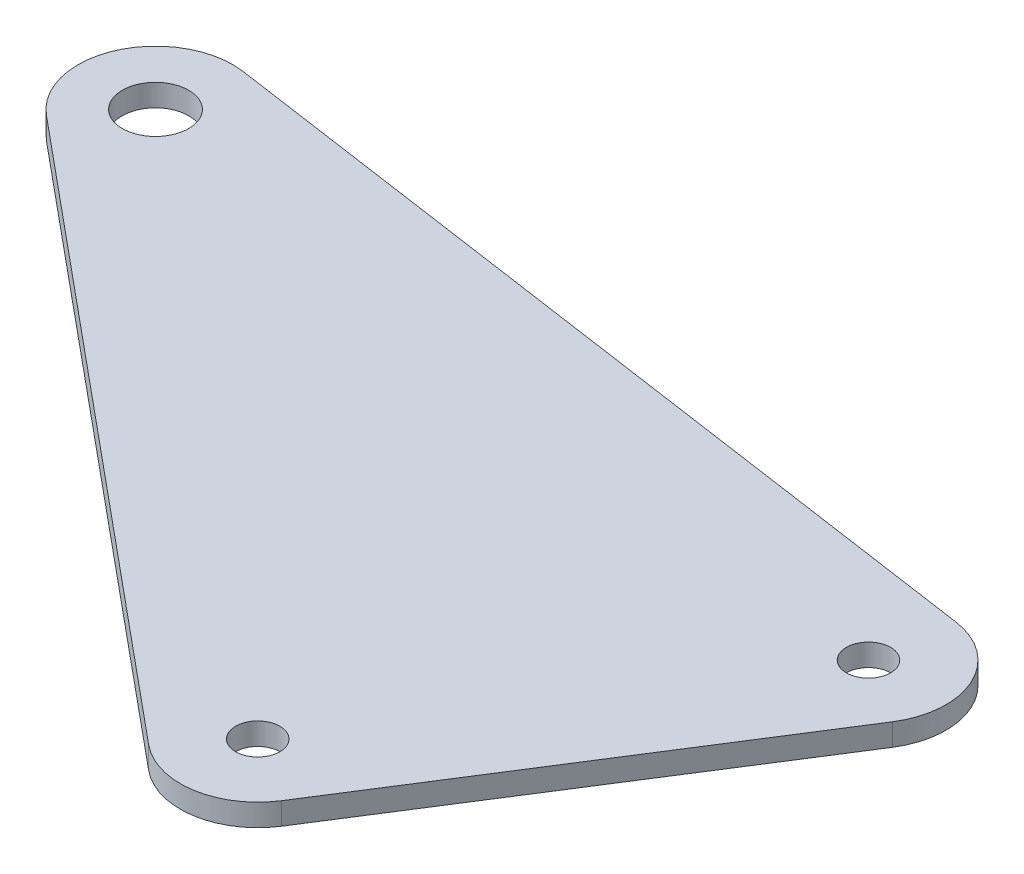
ISO-10303-21;
HEADER;
FILE_DESCRIPTION(('STEP AP214'),'2;1');
FILE_NAME('part.step','',(''),(''),'','','');
FILE_SCHEMA(('AUTOMOTIVE_DESIGN { 1 0 10303 214 1 1 1 1 }'));
ENDSEC;
DATA;
#1=APPLICATION_CONTEXT('core data for automotive mechanical design processes');
#2=APPLICATION_PROTOCOL_DEFINITION('international standard','automotive_design',2000,#1);
#3=PRODUCT_CONTEXT('',#1,'mechanical');
#4=PRODUCT('Part','Part','',(#3));
#5=PRODUCT_RELATED_PRODUCT_CATEGORY('part','',(#4));
#6=PRODUCT_DEFINITION_FORMATION('','',#4);
#7=PRODUCT_DEFINITION_CONTEXT('part definition',#1,'design');
#8=PRODUCT_DEFINITION('design','',#6,#7);
#9=PRODUCT_DEFINITION_SHAPE('','',#8);
#10=(LENGTH_UNIT() NAMED_UNIT(*) SI_UNIT(.MILLI.,.METRE.));
#11=(NAMED_UNIT(*) PLANE_ANGLE_UNIT() SI_UNIT($,.RADIAN.));
#12=(NAMED_UNIT(*) SI_UNIT($,.STERADIAN.) SOLID_ANGLE_UNIT());
#13=UNCERTAINTY_MEASURE_WITH_UNIT(LENGTH_MEASURE(1.E-05),#10,'distance_accuracy_value','');
#14=(GEOMETRIC_REPRESENTATION_CONTEXT(3) GLOBAL_UNCERTAINTY_ASSIGNED_CONTEXT((#13)) GLOBAL_UNIT_ASSIGNED_CONTEXT((#10,
#11,#12)) REPRESENTATION_CONTEXT('',''));
#15=CARTESIAN_POINT('',(0.,0.,0.));
#16=DIRECTION('',(0.,0.,1.));
#17=DIRECTION('',(1.,0.,0.));
#18=AXIS2_PLACEMENT_3D('',#15,#16,#17);
#19=CARTESIAN_POINT('',(1879.07689268095,2.,-1032.16454737156));
#20=DIRECTION('',(0.,1.,0.));
#21=DIRECTION('',(0.,0.,-1.));
#22=AXIS2_PLACEMENT_3D('',#19,#20,#21);
#23=PLANE('',#22);
#24=CARTESIAN_POINT('',(1857.64903987547,2.,-998.388118842978));
#25=DIRECTION('',(0.,-1.,0.));
#26=DIRECTION('',(0.,0.,-1.));
#27=AXIS2_PLACEMENT_3D('',#24,#25,#26);
#28=CIRCLE('',#27,2.0000000000001);
#29=CARTESIAN_POINT('',(1857.64903987547,2.,-1000.38811884298));
#30=VERTEX_POINT('',#29);
#31=EDGE_CURVE('E154',#30,#30,#28,.T.);
#32=ORIENTED_EDGE('',*,*,#31,.T.);
#33=EDGE_LOOP('',(#32));
#34=FACE_BOUND('',#33,.T.);
#35=CARTESIAN_POINT('',(1879.07689268095,2.,-1032.16454737156));
#36=DIRECTION('',(0.,-1.,0.));
#37=DIRECTION('',(0.,0.,-1.));
#38=AXIS2_PLACEMENT_3D('',#35,#36,#37);
#39=CIRCLE('',#38,7.00000000000004);
#40=CARTESIAN_POINT('',(1880.077927524,2.,-1039.09260115621));
#41=VERTEX_POINT('',#40);
#42=CARTESIAN_POINT('',(1884.98776767346,2.,-1028.4146731306));
#43=VERTEX_POINT('',#42);
#44=EDGE_CURVE('E137',#41,#43,#39,.T.);
#45=ORIENTED_EDGE('',*,*,#44,.F.);
#46=DIRECTION('',(0.989721969235761,0.,0.143004977578013));
#47=VECTOR('',#46,1.);
#48=CARTESIAN_POINT('',(1880.077927524,2.,-1039.09260115621));
#49=LINE('',#48,#47);
#50=CARTESIAN_POINT('',(1804.74821126252,2.,-1049.97699568294));
#51=VERTEX_POINT('',#50);
#52=EDGE_CURVE('E117',#51,#41,#49,.T.);
#53=ORIENTED_EDGE('',*,*,#52,.F.);
#54=CARTESIAN_POINT('',(1803.74717641947,2.,-1043.04894189829));
#55=DIRECTION('',(0.,-1.,0.));
#56=DIRECTION('',(0.,0.,-1.));
#57=AXIS2_PLACEMENT_3D('',#54,#55,#56);
#58=CIRCLE('',#57,6.99999999999989);
#59=CARTESIAN_POINT('',(1799.28109411394,2.,-1037.6587555527));
#60=VERTEX_POINT('',#59);
#61=EDGE_CURVE('E98',#60,#51,#58,.T.);
#62=ORIENTED_EDGE('',*,*,#61,.F.);
#63=DIRECTION('',(-0.770026620799455,0.,-0.638011757932542));
#64=VECTOR('',#63,1.);
#65=CARTESIAN_POINT('',(1799.28109411394,2.,-1037.6587555527));
#66=LINE('',#65,#64);
#67=CARTESIAN_POINT('',(1853.18295756995,2.,-992.997932497383));
#68=VERTEX_POINT('',#67);
#69=EDGE_CURVE('E108',#68,#60,#66,.T.);
#70=ORIENTED_EDGE('',*,*,#69,.F.);
#71=CARTESIAN_POINT('',(1857.64903987547,2.,-998.388118842978));
#72=DIRECTION('',(0.,-1.,0.));
#73=DIRECTION('',(0.,0.,-1.));
#74=AXIS2_PLACEMENT_3D('',#71,#72,#73);
#75=CIRCLE('',#74,6.99999999999981);
#76=CARTESIAN_POINT('',(1863.55991486798,2.,-994.638244602019));
#77=VERTEX_POINT('',#76);
#78=EDGE_CURVE('E113',#77,#68,#75,.T.);
#79=ORIENTED_EDGE('',*,*,#78,.F.);
#80=DIRECTION('',(-0.535696320137016,0.,0.844410713214642));
#81=VECTOR('',#80,1.);
#82=CARTESIAN_POINT('',(1884.98776767346,2.,-1028.4146731306));
#83=LINE('',#82,#81);
#84=EDGE_CURVE('E142',#43,#77,#83,.T.);
#85=ORIENTED_EDGE('',*,*,#84,.F.);
#86=EDGE_LOOP('',(#45,#53,#62,#70,#79,#85));
#87=FACE_BOUND('',#86,.T.);
#88=CARTESIAN_POINT('',(1803.74717641947,2.,-1043.04894189829));
#89=DIRECTION('',(0.,-1.,0.));
#90=DIRECTION('',(0.,0.,-1.));
#91=AXIS2_PLACEMENT_3D('',#88,#89,#90);
#92=CIRCLE('',#91,2.99999999999994);
#93=CARTESIAN_POINT('',(1803.74717641947,2.,-1046.04894189829));
#94=VERTEX_POINT('',#93);
#95=EDGE_CURVE('E126',#94,#94,#92,.T.);
#96=ORIENTED_EDGE('',*,*,#95,.T.);
#97=EDGE_LOOP('',(#96));
#98=FACE_BOUND('',#97,.T.);
#99=CARTESIAN_POINT('',(1879.07689268095,2.,-1032.16454737156));
#100=DIRECTION('',(0.,-1.,0.));
#101=DIRECTION('',(0.,0.,-1.));
#102=AXIS2_PLACEMENT_3D('',#99,#100,#101);
#103=CIRCLE('',#102,2.0000000000001);
#104=CARTESIAN_POINT('',(1879.07689268095,2.,-1034.16454737156));
#105=VERTEX_POINT('',#104);
#106=EDGE_CURVE('E160',#105,#105,#103,.T.);
#107=ORIENTED_EDGE('',*,*,#106,.T.);
#108=EDGE_LOOP('',(#107));
#109=FACE_BOUND('',#108,.T.);
#110=ADVANCED_FACE('F37',(#34,#87,#98,#109),#23,.T.);
#111=CARTESIAN_POINT('',(1879.07689268095,0.,-1032.16454737156));
#112=DIRECTION('',(0.,1.,0.));
#113=DIRECTION('',(0.,0.,-1.));
#114=AXIS2_PLACEMENT_3D('',#111,#112,#113);
#115=PLANE('',#114);
#116=CARTESIAN_POINT('',(1879.07689268095,0.,-1032.16454737156));
#117=DIRECTION('',(0.,-1.,0.));
#118=DIRECTION('',(0.,0.,-1.));
#119=AXIS2_PLACEMENT_3D('',#116,#117,#118);
#120=CIRCLE('',#119,7.00000000000004);
#121=CARTESIAN_POINT('',(1880.077927524,0.,-1039.09260115621));
#122=VERTEX_POINT('',#121);
#123=CARTESIAN_POINT('',(1884.98776767346,0.,-1028.4146731306));
#124=VERTEX_POINT('',#123);
#125=EDGE_CURVE('E122',#122,#124,#120,.T.);
#126=ORIENTED_EDGE('',*,*,#125,.T.);
#127=DIRECTION('',(-0.535696320137016,0.,0.844410713214642));
#128=VECTOR('',#127,1.);
#129=CARTESIAN_POINT('',(1884.98776767346,0.,-1028.4146731306));
#130=LINE('',#129,#128);
#131=CARTESIAN_POINT('',(1863.55991486798,0.,-994.638244602019));
#132=VERTEX_POINT('',#131);
#133=EDGE_CURVE('E125',#124,#132,#130,.T.);
#134=ORIENTED_EDGE('',*,*,#133,.T.);
#135=CARTESIAN_POINT('',(1857.64903987547,0.,-998.388118842978));
#136=DIRECTION('',(0.,-1.,0.));
#137=DIRECTION('',(0.,0.,-1.));
#138=AXIS2_PLACEMENT_3D('',#135,#136,#137);
#139=CIRCLE('',#138,6.99999999999981);
#140=CARTESIAN_POINT('',(1853.18295756995,0.,-992.997932497383));
#141=VERTEX_POINT('',#140);
#142=EDGE_CURVE('E129',#132,#141,#139,.T.);
#143=ORIENTED_EDGE('',*,*,#142,.T.);
#144=DIRECTION('',(-0.770026620799455,0.,-0.638011757932542));
#145=VECTOR('',#144,1.);
#146=CARTESIAN_POINT('',(1799.28109411394,0.,-1037.6587555527));
#147=LINE('',#146,#145);
#148=CARTESIAN_POINT('',(1799.28109411394,0.,-1037.6587555527));
#149=VERTEX_POINT('',#148);
#150=EDGE_CURVE('E132',#141,#149,#147,.T.);
#151=ORIENTED_EDGE('',*,*,#150,.T.);
#152=CARTESIAN_POINT('',(1803.74717641947,0.,-1043.04894189829));
#153=DIRECTION('',(0.,-1.,0.));
#154=DIRECTION('',(0.,0.,-1.));
#155=AXIS2_PLACEMENT_3D('',#152,#153,#154);
#156=CIRCLE('',#155,6.99999999999989);
#157=CARTESIAN_POINT('',(1804.74821126252,0.,-1049.97699568294));
#158=VERTEX_POINT('',#157);
#159=EDGE_CURVE('E101',#149,#158,#156,.T.);
#160=ORIENTED_EDGE('',*,*,#159,.T.);
#161=DIRECTION('',(0.989721969235761,0.,0.143004977578013));
#162=VECTOR('',#161,1.);
#163=CARTESIAN_POINT('',(1880.077927524,0.,-1039.09260115621));
#164=LINE('',#163,#162);
#165=EDGE_CURVE('E135',#158,#122,#164,.T.);
#166=ORIENTED_EDGE('',*,*,#165,.T.);
#167=EDGE_LOOP('',(#126,#134,#143,#151,#160,#166));
#168=FACE_BOUND('',#167,.T.);
#169=CARTESIAN_POINT('',(1803.74717641947,0.,-1043.04894189829));
#170=DIRECTION('',(0.,-1.,0.));
#171=DIRECTION('',(0.,0.,-1.));
#172=AXIS2_PLACEMENT_3D('',#169,#170,#171);
#173=CIRCLE('',#172,2.99999999999994);
#174=CARTESIAN_POINT('',(1803.74717641947,0.,-1046.04894189829));
#175=VERTEX_POINT('',#174);
#176=EDGE_CURVE('E151',#175,#175,#173,.T.);
#177=ORIENTED_EDGE('',*,*,#176,.F.);
#178=EDGE_LOOP('',(#177));
#179=FACE_BOUND('',#178,.T.);
#180=CARTESIAN_POINT('',(1857.64903987547,0.,-998.388118842978));
#181=DIRECTION('',(0.,-1.,0.));
#182=DIRECTION('',(0.,0.,-1.));
#183=AXIS2_PLACEMENT_3D('',#180,#181,#182);
#184=CIRCLE('',#183,2.0000000000001);
#185=CARTESIAN_POINT('',(1857.64903987547,0.,-1000.38811884298));
#186=VERTEX_POINT('',#185);
#187=EDGE_CURVE('E157',#186,#186,#184,.T.);
#188=ORIENTED_EDGE('',*,*,#187,.F.);
#189=EDGE_LOOP('',(#188));
#190=FACE_BOUND('',#189,.T.);
#191=CARTESIAN_POINT('',(1879.07689268095,0.,-1032.16454737156));
#192=DIRECTION('',(0.,-1.,0.));
#193=DIRECTION('',(0.,0.,-1.));
#194=AXIS2_PLACEMENT_3D('',#191,#192,#193);
#195=CIRCLE('',#194,2.0000000000001);
#196=CARTESIAN_POINT('',(1879.07689268095,0.,-1034.16454737156));
#197=VERTEX_POINT('',#196);
#198=EDGE_CURVE('E163',#197,#197,#195,.T.);
#199=ORIENTED_EDGE('',*,*,#198,.F.);
#200=EDGE_LOOP('',(#199));
#201=FACE_BOUND('',#200,.T.);
#202=ADVANCED_FACE('F146',(#168,#179,#190,#201),#115,.F.);
#203=CARTESIAN_POINT('',(1879.07689268095,2.,-1032.16454737156));
#204=DIRECTION('',(0.,-1.,0.));
#205=DIRECTION('',(0.,0.,1.));
#206=AXIS2_PLACEMENT_3D('',#203,#204,#205);
#207=CYLINDRICAL_SURFACE('',#206,7.00000000000004);
#208=ORIENTED_EDGE('',*,*,#125,.F.);
#209=DIRECTION('',(0.,-1.,0.));
#210=VECTOR('',#209,1.);
#211=CARTESIAN_POINT('',(1880.077927524,2.,-1039.09260115621));
#212=LINE('',#211,#210);
#213=EDGE_CURVE('E54',#41,#122,#212,.T.);
#214=ORIENTED_EDGE('',*,*,#213,.F.);
#215=ORIENTED_EDGE('',*,*,#44,.T.);
#216=DIRECTION('',(0.,-1.,0.));
#217=VECTOR('',#216,1.);
#218=CARTESIAN_POINT('',(1884.98776767346,2.,-1028.4146731306));
#219=LINE('',#218,#217);
#220=EDGE_CURVE('E11',#43,#124,#219,.T.);
#221=ORIENTED_EDGE('',*,*,#220,.T.);
#222=EDGE_LOOP('',(#208,#214,#215,#221));
#223=FACE_BOUND('',#222,.T.);
#224=ADVANCED_FACE('F39',(#223),#207,.T.);
#225=CARTESIAN_POINT('',(1884.98776767346,2.,-1028.4146731306));
#226=DIRECTION('',(-0.844410713214642,0.,-0.535696320137016));
#227=DIRECTION('',(0.535696320137016,0.,-0.844410713214642));
#228=AXIS2_PLACEMENT_3D('',#225,#226,#227);
#229=PLANE('',#228);
#230=ORIENTED_EDGE('',*,*,#133,.F.);
#231=ORIENTED_EDGE('',*,*,#220,.F.);
#232=ORIENTED_EDGE('',*,*,#84,.T.);
#233=DIRECTION('',(0.,-1.,0.));
#234=VECTOR('',#233,1.);
#235=CARTESIAN_POINT('',(1863.55991486798,2.,-994.638244602019));
#236=LINE('',#235,#234);
#237=EDGE_CURVE('E46',#77,#132,#236,.T.);
#238=ORIENTED_EDGE('',*,*,#237,.T.);
#239=EDGE_LOOP('',(#230,#231,#232,#238));
#240=FACE_BOUND('',#239,.T.);
#241=ADVANCED_FACE('F141',(#240),#229,.F.);
#242=CARTESIAN_POINT('',(1857.64903987547,2.,-998.388118842978));
#243=DIRECTION('',(0.,-1.,0.));
#244=DIRECTION('',(0.,0.,1.));
#245=AXIS2_PLACEMENT_3D('',#242,#243,#244);
#246=CYLINDRICAL_SURFACE('',#245,6.99999999999981);
#247=ORIENTED_EDGE('',*,*,#142,.F.);
#248=ORIENTED_EDGE('',*,*,#237,.F.);
#249=ORIENTED_EDGE('',*,*,#78,.T.);
#250=DIRECTION('',(0.,-1.,0.));
#251=VECTOR('',#250,1.);
#252=CARTESIAN_POINT('',(1853.18295756995,2.,-992.997932497383));
#253=LINE('',#252,#251);
#254=EDGE_CURVE('E105',#68,#141,#253,.T.);
#255=ORIENTED_EDGE('',*,*,#254,.T.);
#256=EDGE_LOOP('',(#247,#248,#249,#255));
#257=FACE_BOUND('',#256,.T.);
#258=ADVANCED_FACE('F144',(#257),#246,.T.);
#259=CARTESIAN_POINT('',(1799.28109411394,2.,-1037.6587555527));
#260=DIRECTION('',(0.638011757932542,0.,-0.770026620799455));
#261=DIRECTION('',(0.770026620799455,0.,0.638011757932542));
#262=AXIS2_PLACEMENT_3D('',#259,#260,#261);
#263=PLANE('',#262);
#264=ORIENTED_EDGE('',*,*,#150,.F.);
#265=ORIENTED_EDGE('',*,*,#254,.F.);
#266=ORIENTED_EDGE('',*,*,#69,.T.);
#267=DIRECTION('',(0.,-1.,0.));
#268=VECTOR('',#267,1.);
#269=CARTESIAN_POINT('',(1799.28109411394,2.,-1037.6587555527));
#270=LINE('',#269,#268);
#271=EDGE_CURVE('E94',#60,#149,#270,.T.);
#272=ORIENTED_EDGE('',*,*,#271,.T.);
#273=EDGE_LOOP('',(#264,#265,#266,#272));
#274=FACE_BOUND('',#273,.T.);
#275=ADVANCED_FACE('F109',(#274),#263,.F.);
#276=CARTESIAN_POINT('',(1803.74717641947,2.,-1043.04894189829));
#277=DIRECTION('',(0.,-1.,0.));
#278=DIRECTION('',(0.,0.,1.));
#279=AXIS2_PLACEMENT_3D('',#276,#277,#278);
#280=CYLINDRICAL_SURFACE('',#279,6.99999999999989);
#281=ORIENTED_EDGE('',*,*,#159,.F.);
#282=ORIENTED_EDGE('',*,*,#271,.F.);
#283=ORIENTED_EDGE('',*,*,#61,.T.);
#284=DIRECTION('',(0.,-1.,0.));
#285=VECTOR('',#284,1.);
#286=CARTESIAN_POINT('',(1804.74821126252,2.,-1049.97699568294));
#287=LINE('',#286,#285);
#288=EDGE_CURVE('E76',#51,#158,#287,.T.);
#289=ORIENTED_EDGE('',*,*,#288,.T.);
#290=EDGE_LOOP('',(#281,#282,#283,#289));
#291=FACE_BOUND('',#290,.T.);
#292=ADVANCED_FACE('F96',(#291),#280,.T.);
#293=CARTESIAN_POINT('',(1880.077927524,2.,-1039.09260115621));
#294=DIRECTION('',(-0.143004977578013,0.,0.989721969235761));
#295=DIRECTION('',(-0.989721969235761,0.,-0.143004977578013));
#296=AXIS2_PLACEMENT_3D('',#293,#294,#295);
#297=PLANE('',#296);
#298=ORIENTED_EDGE('',*,*,#165,.F.);
#299=ORIENTED_EDGE('',*,*,#288,.F.);
#300=ORIENTED_EDGE('',*,*,#52,.T.);
#301=ORIENTED_EDGE('',*,*,#213,.T.);
#302=EDGE_LOOP('',(#298,#299,#300,#301));
#303=FACE_BOUND('',#302,.T.);
#304=ADVANCED_FACE('F187',(#303),#297,.F.);
#305=CARTESIAN_POINT('',(1803.74717641947,2.,-1043.04894189829));
#306=DIRECTION('',(0.,-1.,0.));
#307=DIRECTION('',(0.,0.,1.));
#308=AXIS2_PLACEMENT_3D('',#305,#306,#307);
#309=CYLINDRICAL_SURFACE('',#308,2.99999999999994);
#310=ORIENTED_EDGE('',*,*,#95,.F.);
#311=EDGE_LOOP('',(#310));
#312=FACE_BOUND('',#311,.T.);
#313=ORIENTED_EDGE('',*,*,#176,.T.);
#314=EDGE_LOOP('',(#313));
#315=FACE_BOUND('',#314,.T.);
#316=ADVANCED_FACE('F190',(#312,#315),#309,.F.);
#317=CARTESIAN_POINT('',(1857.64903987547,2.,-998.388118842978));
#318=DIRECTION('',(0.,-1.,0.));
#319=DIRECTION('',(0.,0.,1.));
#320=AXIS2_PLACEMENT_3D('',#317,#318,#319);
#321=CYLINDRICAL_SURFACE('',#320,2.0000000000001);
#322=ORIENTED_EDGE('',*,*,#31,.F.);
#323=EDGE_LOOP('',(#322));
#324=FACE_BOUND('',#323,.T.);
#325=ORIENTED_EDGE('',*,*,#187,.T.);
#326=EDGE_LOOP('',(#325));
#327=FACE_BOUND('',#326,.T.);
#328=ADVANCED_FACE('F173',(#324,#327),#321,.F.);
#329=CARTESIAN_POINT('',(1879.07689268095,2.,-1032.16454737156));
#330=DIRECTION('',(0.,-1.,0.));
#331=DIRECTION('',(0.,0.,1.));
#332=AXIS2_PLACEMENT_3D('',#329,#330,#331);
#333=CYLINDRICAL_SURFACE('',#332,2.0000000000001);
#334=ORIENTED_EDGE('',*,*,#106,.F.);
#335=EDGE_LOOP('',(#334));
#336=FACE_BOUND('',#335,.T.);
#337=ORIENTED_EDGE('',*,*,#198,.T.);
#338=EDGE_LOOP('',(#337));
#339=FACE_BOUND('',#338,.T.);
#340=ADVANCED_FACE('F170',(#336,#339),#333,.F.);
#341=CLOSED_SHELL('',(#110,#202,#224,#241,#258,#275,#292,#304,#316,#328,#340));
#342=MANIFOLD_SOLID_BREP('B2',#341);
#343=ADVANCED_BREP_SHAPE_REPRESENTATION('',(#18,#342),#14);
#344=SHAPE_DEFINITION_REPRESENTATION(#9,#343);
ENDSEC;
END-ISO-10303-21;
